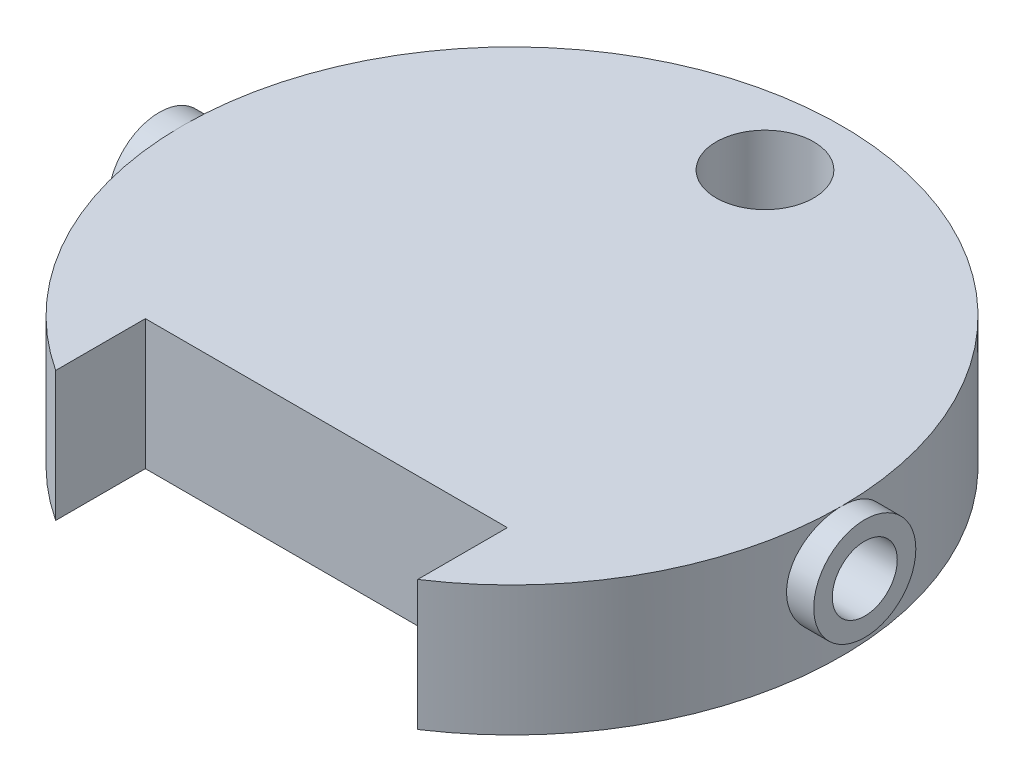
ISO-10303-21;
HEADER;
FILE_DESCRIPTION(('STEP AP214'),'2;1');
FILE_NAME('part.step','',(''),(''),'','','');
FILE_SCHEMA(('AUTOMOTIVE_DESIGN { 1 0 10303 214 1 1 1 1 }'));
ENDSEC;
DATA;
#1=APPLICATION_CONTEXT('core data for automotive mechanical design processes');
#2=APPLICATION_PROTOCOL_DEFINITION('international standard','automotive_design',2000,#1);
#3=PRODUCT_CONTEXT('',#1,'mechanical');
#4=PRODUCT('Part','Part','',(#3));
#5=PRODUCT_RELATED_PRODUCT_CATEGORY('part','',(#4));
#6=PRODUCT_DEFINITION_FORMATION('','',#4);
#7=PRODUCT_DEFINITION_CONTEXT('part definition',#1,'design');
#8=PRODUCT_DEFINITION('design','',#6,#7);
#9=PRODUCT_DEFINITION_SHAPE('','',#8);
#10=(LENGTH_UNIT() NAMED_UNIT(*) SI_UNIT(.MILLI.,.METRE.));
#11=(NAMED_UNIT(*) PLANE_ANGLE_UNIT() SI_UNIT($,.RADIAN.));
#12=(NAMED_UNIT(*) SI_UNIT($,.STERADIAN.) SOLID_ANGLE_UNIT());
#13=UNCERTAINTY_MEASURE_WITH_UNIT(LENGTH_MEASURE(1.E-05),#10,'distance_accuracy_value','');
#14=(GEOMETRIC_REPRESENTATION_CONTEXT(3) GLOBAL_UNCERTAINTY_ASSIGNED_CONTEXT((#13)) GLOBAL_UNIT_ASSIGNED_CONTEXT((#10,
#11,#12)) REPRESENTATION_CONTEXT('',''));
#15=CARTESIAN_POINT('',(0.,0.,0.));
#16=DIRECTION('',(0.,0.,1.));
#17=DIRECTION('',(1.,0.,0.));
#18=AXIS2_PLACEMENT_3D('',#15,#16,#17);
#19=CARTESIAN_POINT('',(-2.65,-0.85,-0.5));
#20=DIRECTION('',(-1.,0.,0.));
#21=DIRECTION('',(0.,0.,1.));
#22=AXIS2_PLACEMENT_3D('',#19,#20,#21);
#23=PLANE('',#22);
#24=CARTESIAN_POINT('',(-2.65,0.,0.));
#25=DIRECTION('',(-1.,0.,0.));
#26=DIRECTION('',(0.,0.,1.));
#27=AXIS2_PLACEMENT_3D('',#24,#25,#26);
#28=CIRCLE('',#27,0.35);
#29=CARTESIAN_POINT('',(-2.65,0.,0.35));
#30=VERTEX_POINT('',#29);
#31=EDGE_CURVE('E273',#30,#30,#28,.T.);
#32=ORIENTED_EDGE('',*,*,#31,.T.);
#33=EDGE_LOOP('',(#32));
#34=FACE_BOUND('',#33,.T.);
#35=DIRECTION('',(0.,0.,1.));
#36=VECTOR('',#35,1.);
#37=CARTESIAN_POINT('',(-2.65,0.45,-0.5));
#38=LINE('',#37,#36);
#39=CARTESIAN_POINT('',(-2.65,0.45,-0.5));
#40=VERTEX_POINT('',#39);
#41=CARTESIAN_POINT('',(-2.65,0.45,0.499999999999999));
#42=VERTEX_POINT('',#41);
#43=EDGE_CURVE('E132',#40,#42,#38,.T.);
#44=ORIENTED_EDGE('',*,*,#43,.T.);
#45=DIRECTION('',(0.,1.,0.));
#46=VECTOR('',#45,1.);
#47=CARTESIAN_POINT('',(-2.65,-0.85,0.5));
#48=LINE('',#47,#46);
#49=CARTESIAN_POINT('',(-2.65,-0.85,0.5));
#50=VERTEX_POINT('',#49);
#51=EDGE_CURVE('E117',#50,#42,#48,.T.);
#52=ORIENTED_EDGE('',*,*,#51,.F.);
#53=DIRECTION('',(0.,0.,1.));
#54=VECTOR('',#53,1.);
#55=CARTESIAN_POINT('',(-2.65,-0.85,-0.5));
#56=LINE('',#55,#54);
#57=CARTESIAN_POINT('',(-2.65,-0.85,-0.5));
#58=VERTEX_POINT('',#57);
#59=EDGE_CURVE('E234',#58,#50,#56,.T.);
#60=ORIENTED_EDGE('',*,*,#59,.F.);
#61=DIRECTION('',(0.,1.,0.));
#62=VECTOR('',#61,1.);
#63=CARTESIAN_POINT('',(-2.65,-0.85,-0.5));
#64=LINE('',#63,#62);
#65=EDGE_CURVE('E133',#58,#40,#64,.T.);
#66=ORIENTED_EDGE('',*,*,#65,.T.);
#67=EDGE_LOOP('',(#44,#52,#60,#66));
#68=FACE_BOUND('',#67,.T.);
#69=ADVANCED_FACE('F45',(#34,#68),#23,.F.);
#70=CARTESIAN_POINT('',(-2.65,-0.85,-0.5));
#71=DIRECTION('',(0.,0.,-1.));
#72=DIRECTION('',(-1.,0.,0.));
#73=AXIS2_PLACEMENT_3D('',#70,#71,#72);
#74=PLANE('',#73);
#75=DIRECTION('',(-1.,0.,0.));
#76=VECTOR('',#75,1.);
#77=CARTESIAN_POINT('',(-2.65,0.45,-0.5));
#78=LINE('',#77,#76);
#79=CARTESIAN_POINT('',(2.65,0.45,-0.500000000000001));
#80=VERTEX_POINT('',#79);
#81=EDGE_CURVE('E62',#80,#40,#78,.T.);
#82=ORIENTED_EDGE('',*,*,#81,.T.);
#83=ORIENTED_EDGE('',*,*,#65,.F.);
#84=DIRECTION('',(-1.,0.,0.));
#85=VECTOR('',#84,1.);
#86=CARTESIAN_POINT('',(-2.65,-0.85,-0.5));
#87=LINE('',#86,#85);
#88=CARTESIAN_POINT('',(2.65,-0.85,-0.500000000000001));
#89=VERTEX_POINT('',#88);
#90=EDGE_CURVE('E129',#89,#58,#87,.T.);
#91=ORIENTED_EDGE('',*,*,#90,.F.);
#92=DIRECTION('',(0.,1.,0.));
#93=VECTOR('',#92,1.);
#94=CARTESIAN_POINT('',(2.65,-0.85,-0.500000000000001));
#95=LINE('',#94,#93);
#96=EDGE_CURVE('E247',#89,#80,#95,.T.);
#97=ORIENTED_EDGE('',*,*,#96,.T.);
#98=EDGE_LOOP('',(#82,#83,#91,#97));
#99=FACE_BOUND('',#98,.T.);
#100=ADVANCED_FACE('F174',(#99),#74,.F.);
#101=CARTESIAN_POINT('',(2.65,-0.85,-0.500000000000001));
#102=DIRECTION('',(1.,0.,0.));
#103=DIRECTION('',(0.,0.,-1.));
#104=AXIS2_PLACEMENT_3D('',#101,#102,#103);
#105=PLANE('',#104);
#106=CARTESIAN_POINT('',(2.65,0.,0.));
#107=DIRECTION('',(1.,0.,0.));
#108=DIRECTION('',(0.,0.,-1.));
#109=AXIS2_PLACEMENT_3D('',#106,#107,#108);
#110=CIRCLE('',#109,0.35);
#111=CARTESIAN_POINT('',(2.65,0.,-0.35));
#112=VERTEX_POINT('',#111);
#113=EDGE_CURVE('E49',#112,#112,#110,.T.);
#114=ORIENTED_EDGE('',*,*,#113,.T.);
#115=EDGE_LOOP('',(#114));
#116=FACE_BOUND('',#115,.T.);
#117=DIRECTION('',(0.,0.,-1.));
#118=VECTOR('',#117,1.);
#119=CARTESIAN_POINT('',(2.65,0.45,-0.5));
#120=LINE('',#119,#118);
#121=CARTESIAN_POINT('',(2.65,0.45,0.499999999999999));
#122=VERTEX_POINT('',#121);
#123=EDGE_CURVE('E70',#122,#80,#120,.T.);
#124=ORIENTED_EDGE('',*,*,#123,.T.);
#125=ORIENTED_EDGE('',*,*,#96,.F.);
#126=DIRECTION('',(0.,0.,-1.));
#127=VECTOR('',#126,1.);
#128=CARTESIAN_POINT('',(2.65,-0.85,-0.500000000000001));
#129=LINE('',#128,#127);
#130=CARTESIAN_POINT('',(2.65,-0.85,0.499999999999999));
#131=VERTEX_POINT('',#130);
#132=EDGE_CURVE('E240',#131,#89,#129,.T.);
#133=ORIENTED_EDGE('',*,*,#132,.F.);
#134=DIRECTION('',(0.,1.,0.));
#135=VECTOR('',#134,1.);
#136=CARTESIAN_POINT('',(2.65,-0.85,0.499999999999999));
#137=LINE('',#136,#135);
#138=EDGE_CURVE('E128',#131,#122,#137,.T.);
#139=ORIENTED_EDGE('',*,*,#138,.T.);
#140=EDGE_LOOP('',(#124,#125,#133,#139));
#141=FACE_BOUND('',#140,.T.);
#142=ADVANCED_FACE('F180',(#116,#141),#105,.F.);
#143=CARTESIAN_POINT('',(-2.65,-0.85,0.5));
#144=DIRECTION('',(0.,0.,1.));
#145=DIRECTION('',(1.,0.,0.));
#146=AXIS2_PLACEMENT_3D('',#143,#144,#145);
#147=PLANE('',#146);
#148=DIRECTION('',(1.,0.,0.));
#149=VECTOR('',#148,1.);
#150=CARTESIAN_POINT('',(-2.65,0.45,0.499999999999999));
#151=LINE('',#150,#149);
#152=EDGE_CURVE('E122',#42,#122,#151,.T.);
#153=ORIENTED_EDGE('',*,*,#152,.T.);
#154=ORIENTED_EDGE('',*,*,#138,.F.);
#155=DIRECTION('',(1.,0.,0.));
#156=VECTOR('',#155,1.);
#157=CARTESIAN_POINT('',(-2.65,-0.85,0.5));
#158=LINE('',#157,#156);
#159=EDGE_CURVE('E124',#50,#131,#158,.T.);
#160=ORIENTED_EDGE('',*,*,#159,.F.);
#161=ORIENTED_EDGE('',*,*,#51,.T.);
#162=EDGE_LOOP('',(#153,#154,#160,#161));
#163=FACE_BOUND('',#162,.T.);
#164=ADVANCED_FACE('F119',(#163),#147,.F.);
#165=CARTESIAN_POINT('',(0.,-0.85,0.));
#166=DIRECTION('',(0.,1.,0.));
#167=DIRECTION('',(0.,0.,1.));
#168=AXIS2_PLACEMENT_3D('',#165,#166,#167);
#169=CYLINDRICAL_SURFACE('',#168,3.55);
#170=CARTESIAN_POINT('',(0.,0.55,0.));
#171=DIRECTION('',(0.,1.,0.));
#172=DIRECTION('',(0.,0.,1.));
#173=AXIS2_PLACEMENT_3D('',#170,#171,#172);
#174=CIRCLE('',#173,3.55);
#175=CARTESIAN_POINT('',(-3.55,0.55,0.));
#176=VERTEX_POINT('',#175);
#177=CARTESIAN_POINT('',(-1.95,0.55,2.96647939483827));
#178=VERTEX_POINT('',#177);
#179=EDGE_CURVE('E228',#176,#178,#174,.T.);
#180=ORIENTED_EDGE('',*,*,#179,.F.);
#181=CARTESIAN_POINT('',(-3.50713558335004,0.,0.55));
#182=CARTESIAN_POINT('',(-3.50713610931584,0.0306941712600289,0.549998741464487));
#183=CARTESIAN_POINT('',(-3.50754289515322,0.0614058596014954,0.547421856215872));
#184=CARTESIAN_POINT('',(-3.5091248753284,0.121969701652863,0.537185633231584));
#185=CARTESIAN_POINT('',(-3.51030080749153,0.151821001273753,0.529521415223453));
#186=CARTESIAN_POINT('',(-3.51328476840664,0.209778697197034,0.509346073474204));
#187=CARTESIAN_POINT('',(-3.51509229966173,0.237886446397332,0.496838763694981));
#188=CARTESIAN_POINT('',(-3.5191352054926,0.291600658103021,0.467341409365857));
#189=CARTESIAN_POINT('',(-3.5213705242354,0.317207446364997,0.450351949697311));
#190=CARTESIAN_POINT('',(-3.52603846359392,0.365415062802215,0.412217794503879));
#191=CARTESIAN_POINT('',(-3.52847245997991,0.387991454547622,0.39104237189678));
#192=CARTESIAN_POINT('',(-3.53325124220485,0.429285515342088,0.345203751688893));
#193=CARTESIAN_POINT('',(-3.53559602302581,0.448002967603467,0.320540358271873));
#194=CARTESIAN_POINT('',(-3.53994662430534,0.481138448495561,0.268268823788288));
#195=CARTESIAN_POINT('',(-3.54195064219784,0.495533903851411,0.240646210461065));
#196=CARTESIAN_POINT('',(-3.54537866024941,0.519471830629264,0.183338882422309));
#197=CARTESIAN_POINT('',(-3.54680269306128,0.529014575263362,0.153654283909422));
#198=CARTESIAN_POINT('',(-3.54890058337958,0.542901925064896,0.0933175326452187));
#199=CARTESIAN_POINT('',(-3.54958034947307,0.547287492978124,0.0626750168160162));
#200=CARTESIAN_POINT('',(-3.55013338005438,0.550863244039609,0.00108201260270235));
#201=CARTESIAN_POINT('',(-3.55000669222643,0.550053734363935,-0.0298684574645563));
#202=CARTESIAN_POINT('',(-3.54896579774752,0.543294526807402,-0.0909191562624063));
#203=CARTESIAN_POINT('',(-3.54805834372129,0.537388902486313,-0.121024396090948));
#204=CARTESIAN_POINT('',(-3.54556540180069,0.520674348409114,-0.179811368254253));
#205=CARTESIAN_POINT('',(-3.54397989551796,0.509865285674189,-0.208493061959747));
#206=CARTESIAN_POINT('',(-3.54029742005635,0.483605942068384,-0.263751509288593));
#207=CARTESIAN_POINT('',(-3.53819842494915,0.468137219548343,-0.290319358757163));
#208=CARTESIAN_POINT('',(-3.53372269701819,0.433011133884549,-0.340498875859438));
#209=CARTESIAN_POINT('',(-3.53134594471661,0.413353476910668,-0.364110335934557));
#210=CARTESIAN_POINT('',(-3.52655012724998,0.370162311036761,-0.40796680502866));
#211=CARTESIAN_POINT('',(-3.52413087975596,0.346590309921301,-0.428173904378596));
#212=CARTESIAN_POINT('',(-3.51954699617362,0.296370045883366,-0.464351714785132));
#213=CARTESIAN_POINT('',(-3.51738236185859,0.269721761538194,-0.480322396337505));
#214=CARTESIAN_POINT('',(-3.51355279935454,0.214064596195724,-0.507579805618324));
#215=CARTESIAN_POINT('',(-3.51188830750505,0.185053681847997,-0.51886244662302));
#216=CARTESIAN_POINT('',(-3.50925506017107,0.125517063226174,-0.536384354996999));
#217=CARTESIAN_POINT('',(-3.50828625220066,0.0949914734126746,-0.542624002839676));
#218=CARTESIAN_POINT('',(-3.50716407820933,0.0336298435931897,-0.549830416731066));
#219=CARTESIAN_POINT('',(-3.50700238861831,0.00280027195476128,-0.550851008038018));
#220=CARTESIAN_POINT('',(-3.50749063948571,-0.0585895093671188,-0.547733336012308));
#221=CARTESIAN_POINT('',(-3.50814055301437,-0.0891497279540763,-0.543595243849644));
#222=CARTESIAN_POINT('',(-3.51017112249939,-0.148965354961185,-0.53032339055252));
#223=CARTESIAN_POINT('',(-3.51154783041097,-0.178226895853904,-0.521216611128903));
#224=CARTESIAN_POINT('',(-3.51487359629874,-0.234808289856125,-0.498294024116603));
#225=CARTESIAN_POINT('',(-3.51682268426659,-0.262128041126253,-0.484477969764532));
#226=CARTESIAN_POINT('',(-3.52109313022897,-0.314291138650756,-0.452400351611576));
#227=CARTESIAN_POINT('',(-3.52341734673639,-0.339112881676024,-0.434104044865681));
#228=CARTESIAN_POINT('',(-3.52816763160819,-0.385352925965955,-0.393633409627346));
#229=CARTESIAN_POINT('',(-3.53059370612311,-0.406771021332102,-0.371458846695981));
#230=CARTESIAN_POINT('',(-3.53530045378161,-0.445790018483407,-0.323623699893454));
#231=CARTESIAN_POINT('',(-3.53757963772038,-0.463355184756402,-0.297933798324545));
#232=CARTESIAN_POINT('',(-3.54171245042087,-0.493920360144437,-0.243936602361937));
#233=CARTESIAN_POINT('',(-3.54356609144955,-0.506920500859338,-0.21562938344959));
#234=CARTESIAN_POINT('',(-3.54663245332926,-0.527929923496684,-0.157311113648978));
#235=CARTESIAN_POINT('',(-3.54784764969642,-0.535958504202802,-0.127307150921317));
#236=CARTESIAN_POINT('',(-3.54951061556781,-0.546859276122723,-0.0663566160358489));
#237=CARTESIAN_POINT('',(-3.5499584392953,-0.549731831666701,-0.0354101106362627));
#238=CARTESIAN_POINT('',(-3.55003559536114,-0.550229665095441,0.026200941823071));
#239=CARTESIAN_POINT('',(-3.54967344286087,-0.547909532770154,0.0568650510231499));
#240=CARTESIAN_POINT('',(-3.54818856876239,-0.538205164675676,0.117361422259243));
#241=CARTESIAN_POINT('',(-3.54706585008701,-0.530820948367563,0.147193687491542));
#242=CARTESIAN_POINT('',(-3.54418543966572,-0.511217849174518,0.205162871843964));
#243=CARTESIAN_POINT('',(-3.54242827700281,-0.499002993906364,0.233301180862715));
#244=CARTESIAN_POINT('',(-3.53847164025483,-0.470091241867123,0.287137443952396));
#245=CARTESIAN_POINT('',(-3.53627214989458,-0.453394180168459,0.312835308177438));
#246=CARTESIAN_POINT('',(-3.53164769976064,-0.415795682066542,0.361337574721096));
#247=CARTESIAN_POINT('',(-3.52922071265572,-0.394854029688251,0.384110611723526));
#248=CARTESIAN_POINT('',(-3.52442952322639,-0.349445405732176,0.425838985747292));
#249=CARTESIAN_POINT('',(-3.52206533575646,-0.324977608730262,0.444793426387258));
#250=CARTESIAN_POINT('',(-3.51765212246367,-0.273037364193211,0.478449840455305));
#251=CARTESIAN_POINT('',(-3.51560508107694,-0.245547703682281,0.493125507765082));
#252=CARTESIAN_POINT('',(-3.512081244906,-0.188474294217033,0.517629115484576));
#253=CARTESIAN_POINT('',(-3.51060386495273,-0.158892731287289,0.527462033370906));
#254=CARTESIAN_POINT('',(-3.50872407465987,-0.107652667391019,0.539796712116144));
#255=CARTESIAN_POINT('',(-3.50813159220014,-0.0863089485596777,0.543617010520217));
#256=CARTESIAN_POINT('',(-3.50733716375815,-0.0433130581127662,0.548719080335837));
#257=CARTESIAN_POINT('',(-3.50713521217572,-0.021660890924801,0.550000888149097));
#258=CARTESIAN_POINT('',(-3.50713558335004,0.,0.55));
#259=B_SPLINE_CURVE_WITH_KNOTS('',3,(#181,#182,#183,#184,#185,#186,#187,#188,#189,#190,#191,
#192,#193,#194,#195,#196,#197,#198,#199,#200,#201,#202,#203,#204,#205,#206,#207,#208,#209,#210,
#211,#212,#213,#214,#215,#216,#217,#218,#219,#220,#221,#222,#223,#224,#225,#226,#227,#228,#229,
#230,#231,#232,#233,#234,#235,#236,#237,#238,#239,#240,#241,#242,#243,#244,#245,#246,#247,#248,
#249,#250,#251,#252,#253,#254,#255,#256,#257,#258),.UNSPECIFIED.,.T.,.F.,(4,2,2,2,2,2,2,2,2,2,2,
2,2,2,2,2,2,2,2,2,2,2,2,2,2,2,2,2,2,2,2,2,2,2,2,2,2,2,4),(0.,0.0920033304865069,
0.18409504746144,0.276114388703854,0.368121728161346,0.46083136007846,0.553546198823214,
0.646737173439558,0.739922900736929,0.832363357091383,0.924798347649802,1.01644183942731,
1.10808781667938,1.20010137831443,1.29212139630766,1.38510664209892,1.47809253546224,
1.57115931857424,1.66421907951908,1.75631713123406,1.8484121271299,1.94001192169636,
2.0316165167792,2.12395531690607,2.21629970080433,2.30946740043299,2.40263241401684,
2.49543347112757,2.58822797055955,2.68005152545479,2.77187472747763,2.86362153140944,
2.95537171172583,3.04803564749111,3.14072131000675,3.23396534045337,3.32711333172957,
3.39204105588101,3.45696784896833),.UNSPECIFIED.);
#260=EDGE_CURVE('E141',#176,#176,#259,.T.);
#261=ORIENTED_EDGE('',*,*,#260,.F.);
#262=CARTESIAN_POINT('',(3.55,0.55,0.));
#263=VERTEX_POINT('',#262);
#264=EDGE_CURVE('E269',#263,#176,#174,.T.);
#265=ORIENTED_EDGE('',*,*,#264,.F.);
#266=CARTESIAN_POINT('',(3.50713558335004,0.,-0.55));
#267=CARTESIAN_POINT('',(3.50713610931584,-0.0306941712600289,-0.549998741464487));
#268=CARTESIAN_POINT('',(3.50754289515322,-0.0614058596014954,-0.547421856215872));
#269=CARTESIAN_POINT('',(3.5091248753284,-0.121969701652863,-0.537185633231584));
#270=CARTESIAN_POINT('',(3.51030080749153,-0.151821001273753,-0.529521415223453));
#271=CARTESIAN_POINT('',(3.51328476840664,-0.209778697197034,-0.509346073474204));
#272=CARTESIAN_POINT('',(3.51509229966173,-0.237886446397332,-0.496838763694981));
#273=CARTESIAN_POINT('',(3.5191352054926,-0.291600658103021,-0.467341409365857));
#274=CARTESIAN_POINT('',(3.5213705242354,-0.317207446364997,-0.450351949697311));
#275=CARTESIAN_POINT('',(3.52603846359392,-0.365415062802216,-0.412217794503879));
#276=CARTESIAN_POINT('',(3.52847245997991,-0.387991454547622,-0.39104237189678));
#277=CARTESIAN_POINT('',(3.53325124220485,-0.429285515342088,-0.345203751688893));
#278=CARTESIAN_POINT('',(3.53559602302581,-0.448002967603467,-0.320540358271872));
#279=CARTESIAN_POINT('',(3.53994662430534,-0.481138448495561,-0.268268823788288));
#280=CARTESIAN_POINT('',(3.54195064219784,-0.495533903851411,-0.240646210461064));
#281=CARTESIAN_POINT('',(3.54537866024941,-0.519471830629264,-0.183338882422308));
#282=CARTESIAN_POINT('',(3.54680269306128,-0.529014575263362,-0.153654283909422));
#283=CARTESIAN_POINT('',(3.54890058337958,-0.542901925064897,-0.0933175326452184));
#284=CARTESIAN_POINT('',(3.54958034947307,-0.547287492978124,-0.0626750168160159));
#285=CARTESIAN_POINT('',(3.55013338005438,-0.550863244039608,-0.00108201260270205));
#286=CARTESIAN_POINT('',(3.55000669222643,-0.550053734363935,0.0298684574645566));
#287=CARTESIAN_POINT('',(3.54896579774752,-0.543294526807402,0.0909191562624065));
#288=CARTESIAN_POINT('',(3.54805834372129,-0.537388902486313,0.121024396090949));
#289=CARTESIAN_POINT('',(3.54556540180069,-0.520674348409114,0.179811368254253));
#290=CARTESIAN_POINT('',(3.54397989551796,-0.509865285674189,0.208493061959747));
#291=CARTESIAN_POINT('',(3.54029742005635,-0.483605942068383,0.263751509288593));
#292=CARTESIAN_POINT('',(3.53819842494915,-0.468137219548343,0.290319358757164));
#293=CARTESIAN_POINT('',(3.53372269701819,-0.433011133884548,0.340498875859438));
#294=CARTESIAN_POINT('',(3.53134594471661,-0.413353476910668,0.364110335934557));
#295=CARTESIAN_POINT('',(3.52655012724998,-0.370162311036761,0.40796680502866));
#296=CARTESIAN_POINT('',(3.52413087975596,-0.346590309921301,0.428173904378596));
#297=CARTESIAN_POINT('',(3.51954699617362,-0.296370045883366,0.464351714785131));
#298=CARTESIAN_POINT('',(3.51738236185859,-0.269721761538194,0.480322396337505));
#299=CARTESIAN_POINT('',(3.51355279935454,-0.214064596195724,0.507579805618324));
#300=CARTESIAN_POINT('',(3.51188830750505,-0.185053681847997,0.51886244662302));
#301=CARTESIAN_POINT('',(3.50925506017107,-0.125517063226174,0.536384354996999));
#302=CARTESIAN_POINT('',(3.50828625220066,-0.0949914734126746,0.542624002839676));
#303=CARTESIAN_POINT('',(3.50716407820933,-0.0336298435931897,0.549830416731066));
#304=CARTESIAN_POINT('',(3.50700238861831,-0.00280027195476134,0.550851008038018));
#305=CARTESIAN_POINT('',(3.50749063948571,0.0585895093671188,0.547733336012308));
#306=CARTESIAN_POINT('',(3.50814055301437,0.0891497279540763,0.543595243849644));
#307=CARTESIAN_POINT('',(3.51017112249939,0.148965354961185,0.53032339055252));
#308=CARTESIAN_POINT('',(3.51154783041097,0.178226895853904,0.521216611128903));
#309=CARTESIAN_POINT('',(3.51487359629874,0.234808289856125,0.498294024116603));
#310=CARTESIAN_POINT('',(3.51682268426659,0.262128041126253,0.484477969764531));
#311=CARTESIAN_POINT('',(3.52109313022897,0.314291138650756,0.452400351611576));
#312=CARTESIAN_POINT('',(3.52341734673639,0.339112881676024,0.43410404486568));
#313=CARTESIAN_POINT('',(3.52816763160819,0.385352925965955,0.393633409627346));
#314=CARTESIAN_POINT('',(3.53059370612311,0.406771021332102,0.371458846695981));
#315=CARTESIAN_POINT('',(3.53530045378161,0.445790018483407,0.323623699893453));
#316=CARTESIAN_POINT('',(3.53757963772038,0.463355184756402,0.297933798324545));
#317=CARTESIAN_POINT('',(3.54171245042087,0.493920360144437,0.243936602361937));
#318=CARTESIAN_POINT('',(3.54356609144955,0.506920500859338,0.21562938344959));
#319=CARTESIAN_POINT('',(3.54663245332926,0.527929923496684,0.157311113648978));
#320=CARTESIAN_POINT('',(3.54784764969642,0.535958504202802,0.127307150921316));
#321=CARTESIAN_POINT('',(3.54951061556781,0.546859276122723,0.0663566160358487));
#322=CARTESIAN_POINT('',(3.5499584392953,0.549731831666701,0.0354101106362625));
#323=CARTESIAN_POINT('',(3.55003559536114,0.550229665095441,-0.0262009418230711));
#324=CARTESIAN_POINT('',(3.54967344286087,0.547909532770154,-0.0568650510231499));
#325=CARTESIAN_POINT('',(3.54818856876239,0.538205164675676,-0.117361422259243));
#326=CARTESIAN_POINT('',(3.54706585008701,0.530820948367563,-0.147193687491542));
#327=CARTESIAN_POINT('',(3.54418543966572,0.511217849174518,-0.205162871843964));
#328=CARTESIAN_POINT('',(3.54242827700281,0.499002993906364,-0.233301180862715));
#329=CARTESIAN_POINT('',(3.53847164025483,0.470091241867123,-0.287137443952396));
#330=CARTESIAN_POINT('',(3.53627214989458,0.453394180168459,-0.312835308177438));
#331=CARTESIAN_POINT('',(3.53164769976064,0.415795682066542,-0.361337574721096));
#332=CARTESIAN_POINT('',(3.52922071265572,0.394854029688251,-0.384110611723526));
#333=CARTESIAN_POINT('',(3.52442952322639,0.349445405732176,-0.425838985747292));
#334=CARTESIAN_POINT('',(3.52206533575646,0.324977608730262,-0.444793426387258));
#335=CARTESIAN_POINT('',(3.51765212246367,0.273037364193211,-0.478449840455305));
#336=CARTESIAN_POINT('',(3.51560508107694,0.245547703682281,-0.493125507765081));
#337=CARTESIAN_POINT('',(3.512081244906,0.188474294217033,-0.517629115484576));
#338=CARTESIAN_POINT('',(3.51060386495273,0.158892731287289,-0.527462033370906));
#339=CARTESIAN_POINT('',(3.50872407465987,0.107652667391019,-0.539796712116144));
#340=CARTESIAN_POINT('',(3.50813159220014,0.0863089485596777,-0.543617010520217));
#341=CARTESIAN_POINT('',(3.50733716375815,0.0433130581127662,-0.548719080335837));
#342=CARTESIAN_POINT('',(3.50713521217572,0.021660890924801,-0.550000888149097));
#343=CARTESIAN_POINT('',(3.50713558335004,0.,-0.55));
#344=B_SPLINE_CURVE_WITH_KNOTS('',3,(#266,#267,#268,#269,#270,#271,#272,#273,#274,#275,#276,
#277,#278,#279,#280,#281,#282,#283,#284,#285,#286,#287,#288,#289,#290,#291,#292,#293,#294,#295,
#296,#297,#298,#299,#300,#301,#302,#303,#304,#305,#306,#307,#308,#309,#310,#311,#312,#313,#314,
#315,#316,#317,#318,#319,#320,#321,#322,#323,#324,#325,#326,#327,#328,#329,#330,#331,#332,#333,
#334,#335,#336,#337,#338,#339,#340,#341,#342,#343),.UNSPECIFIED.,.T.,.F.,(4,2,2,2,2,2,2,2,2,2,2,
2,2,2,2,2,2,2,2,2,2,2,2,2,2,2,2,2,2,2,2,2,2,2,2,2,2,2,4),(0.,0.0920033304865069,
0.18409504746144,0.276114388703854,0.368121728161346,0.46083136007846,0.553546198823214,
0.646737173439558,0.73992290073693,0.832363357091383,0.924798347649802,1.01644183942731,
1.10808781667938,1.20010137831443,1.29212139630766,1.38510664209892,1.47809253546224,
1.57115931857424,1.66421907951907,1.75631713123406,1.8484121271299,1.94001192169636,
2.0316165167792,2.12395531690607,2.21629970080433,2.30946740043299,2.40263241401684,
2.49543347112757,2.58822797055955,2.68005152545479,2.77187472747763,2.86362153140944,
2.95537171172583,3.0480356474911,3.14072131000675,3.23396534045337,3.32711333172957,
3.39204105588101,3.45696784896833),.UNSPECIFIED.);
#345=EDGE_CURVE('E145',#263,#263,#344,.T.);
#346=ORIENTED_EDGE('',*,*,#345,.T.);
#347=CARTESIAN_POINT('',(1.95,0.55,2.96647939483826));
#348=VERTEX_POINT('',#347);
#349=EDGE_CURVE('E230',#348,#263,#174,.T.);
#350=ORIENTED_EDGE('',*,*,#349,.F.);
#351=DIRECTION('',(0.,1.,0.));
#352=VECTOR('',#351,1.);
#353=CARTESIAN_POINT('',(1.95,-0.85,2.96647939483826));
#354=LINE('',#353,#352);
#355=CARTESIAN_POINT('',(1.95,-0.85,2.96647939483826));
#356=VERTEX_POINT('',#355);
#357=EDGE_CURVE('E12',#356,#348,#354,.T.);
#358=ORIENTED_EDGE('',*,*,#357,.F.);
#359=CARTESIAN_POINT('',(0.,-0.85,0.));
#360=DIRECTION('',(0.,1.,0.));
#361=DIRECTION('',(0.,0.,1.));
#362=AXIS2_PLACEMENT_3D('',#359,#360,#361);
#363=CIRCLE('',#362,3.55);
#364=CARTESIAN_POINT('',(-1.95,-0.85,2.96647939483827));
#365=VERTEX_POINT('',#364);
#366=EDGE_CURVE('E252',#356,#365,#363,.T.);
#367=ORIENTED_EDGE('',*,*,#366,.T.);
#368=DIRECTION('',(0.,1.,0.));
#369=VECTOR('',#368,1.);
#370=CARTESIAN_POINT('',(-1.95,-0.85,2.96647939483827));
#371=LINE('',#370,#369);
#372=EDGE_CURVE('E218',#365,#178,#371,.T.);
#373=ORIENTED_EDGE('',*,*,#372,.T.);
#374=EDGE_LOOP('',(#180,#261,#265,#346,#350,#358,#367,#373));
#375=FACE_BOUND('',#374,.T.);
#376=ADVANCED_FACE('F47',(#375),#169,.T.);
#377=CARTESIAN_POINT('',(1.95,-0.85,2.96647939483826));
#378=DIRECTION('',(-1.,0.,0.));
#379=DIRECTION('',(0.,0.,1.));
#380=AXIS2_PLACEMENT_3D('',#377,#378,#379);
#381=PLANE('',#380);
#382=ORIENTED_EDGE('',*,*,#357,.T.);
#383=DIRECTION('',(0.,0.,1.));
#384=VECTOR('',#383,1.);
#385=CARTESIAN_POINT('',(1.95,0.55,2.96647939483826));
#386=LINE('',#385,#384);
#387=CARTESIAN_POINT('',(1.95,0.55,2.));
#388=VERTEX_POINT('',#387);
#389=EDGE_CURVE('E232',#388,#348,#386,.T.);
#390=ORIENTED_EDGE('',*,*,#389,.F.);
#391=DIRECTION('',(0.,1.,0.));
#392=VECTOR('',#391,1.);
#393=CARTESIAN_POINT('',(1.95,-0.85,2.));
#394=LINE('',#393,#392);
#395=CARTESIAN_POINT('',(1.95,-0.85,2.));
#396=VERTEX_POINT('',#395);
#397=EDGE_CURVE('E54',#396,#388,#394,.T.);
#398=ORIENTED_EDGE('',*,*,#397,.F.);
#399=DIRECTION('',(0.,0.,1.));
#400=VECTOR('',#399,1.);
#401=CARTESIAN_POINT('',(1.95,-0.85,2.96647939483826));
#402=LINE('',#401,#400);
#403=EDGE_CURVE('E257',#396,#356,#402,.T.);
#404=ORIENTED_EDGE('',*,*,#403,.T.);
#405=EDGE_LOOP('',(#382,#390,#398,#404));
#406=FACE_BOUND('',#405,.T.);
#407=ADVANCED_FACE('F196',(#406),#381,.T.);
#408=CARTESIAN_POINT('',(-1.95,-0.85,2.));
#409=DIRECTION('',(0.,0.,1.));
#410=DIRECTION('',(1.,0.,0.));
#411=AXIS2_PLACEMENT_3D('',#408,#409,#410);
#412=PLANE('',#411);
#413=ORIENTED_EDGE('',*,*,#397,.T.);
#414=DIRECTION('',(1.,0.,0.));
#415=VECTOR('',#414,1.);
#416=CARTESIAN_POINT('',(-1.95,0.55,2.));
#417=LINE('',#416,#415);
#418=CARTESIAN_POINT('',(-1.95,0.55,2.));
#419=VERTEX_POINT('',#418);
#420=EDGE_CURVE('E224',#419,#388,#417,.T.);
#421=ORIENTED_EDGE('',*,*,#420,.F.);
#422=DIRECTION('',(0.,1.,0.));
#423=VECTOR('',#422,1.);
#424=CARTESIAN_POINT('',(-1.95,-0.85,2.));
#425=LINE('',#424,#423);
#426=CARTESIAN_POINT('',(-1.95,-0.85,2.));
#427=VERTEX_POINT('',#426);
#428=EDGE_CURVE('E209',#427,#419,#425,.T.);
#429=ORIENTED_EDGE('',*,*,#428,.F.);
#430=DIRECTION('',(1.,0.,0.));
#431=VECTOR('',#430,1.);
#432=CARTESIAN_POINT('',(-1.95,-0.85,2.));
#433=LINE('',#432,#431);
#434=EDGE_CURVE('E255',#427,#396,#433,.T.);
#435=ORIENTED_EDGE('',*,*,#434,.T.);
#436=EDGE_LOOP('',(#413,#421,#429,#435));
#437=FACE_BOUND('',#436,.T.);
#438=ADVANCED_FACE('F199',(#437),#412,.T.);
#439=CARTESIAN_POINT('',(-1.95,-0.85,2.96647939483827));
#440=DIRECTION('',(1.,0.,0.));
#441=DIRECTION('',(0.,0.,-1.));
#442=AXIS2_PLACEMENT_3D('',#439,#440,#441);
#443=PLANE('',#442);
#444=ORIENTED_EDGE('',*,*,#428,.T.);
#445=DIRECTION('',(0.,0.,-1.));
#446=VECTOR('',#445,1.);
#447=CARTESIAN_POINT('',(-1.95,0.55,2.96647939483827));
#448=LINE('',#447,#446);
#449=EDGE_CURVE('E212',#178,#419,#448,.T.);
#450=ORIENTED_EDGE('',*,*,#449,.F.);
#451=ORIENTED_EDGE('',*,*,#372,.F.);
#452=DIRECTION('',(0.,0.,-1.));
#453=VECTOR('',#452,1.);
#454=CARTESIAN_POINT('',(-1.95,-0.85,2.96647939483827));
#455=LINE('',#454,#453);
#456=EDGE_CURVE('E214',#365,#427,#455,.T.);
#457=ORIENTED_EDGE('',*,*,#456,.T.);
#458=EDGE_LOOP('',(#444,#450,#451,#457));
#459=FACE_BOUND('',#458,.T.);
#460=ADVANCED_FACE('F194',(#459),#443,.T.);
#461=CARTESIAN_POINT('',(0.,-0.85,0.));
#462=DIRECTION('',(0.,1.,0.));
#463=DIRECTION('',(0.,0.,1.));
#464=AXIS2_PLACEMENT_3D('',#461,#462,#463);
#465=PLANE('',#464);
#466=ORIENTED_EDGE('',*,*,#90,.T.);
#467=ORIENTED_EDGE('',*,*,#59,.T.);
#468=ORIENTED_EDGE('',*,*,#159,.T.);
#469=ORIENTED_EDGE('',*,*,#132,.T.);
#470=EDGE_LOOP('',(#466,#467,#468,#469));
#471=FACE_BOUND('',#470,.T.);
#472=CARTESIAN_POINT('',(0.,-0.85,-2.725));
#473=DIRECTION('',(0.,1.,0.));
#474=DIRECTION('',(0.,0.,1.));
#475=AXIS2_PLACEMENT_3D('',#472,#473,#474);
#476=CIRCLE('',#475,0.525);
#477=CARTESIAN_POINT('',(0.,-0.85,-2.2));
#478=VERTEX_POINT('',#477);
#479=EDGE_CURVE('E246',#478,#478,#476,.T.);
#480=ORIENTED_EDGE('',*,*,#479,.T.);
#481=EDGE_LOOP('',(#480));
#482=FACE_BOUND('',#481,.T.);
#483=ORIENTED_EDGE('',*,*,#366,.F.);
#484=ORIENTED_EDGE('',*,*,#403,.F.);
#485=ORIENTED_EDGE('',*,*,#434,.F.);
#486=ORIENTED_EDGE('',*,*,#456,.F.);
#487=EDGE_LOOP('',(#483,#484,#485,#486));
#488=FACE_BOUND('',#487,.T.);
#489=ADVANCED_FACE('F190',(#471,#482,#488),#465,.F.);
#490=CARTESIAN_POINT('',(0.,-0.85,-2.725));
#491=DIRECTION('',(0.,1.,0.));
#492=DIRECTION('',(0.,0.,1.));
#493=AXIS2_PLACEMENT_3D('',#490,#491,#492);
#494=CYLINDRICAL_SURFACE('',#493,0.525);
#495=ORIENTED_EDGE('',*,*,#479,.F.);
#496=EDGE_LOOP('',(#495));
#497=FACE_BOUND('',#496,.T.);
#498=CARTESIAN_POINT('',(0.,0.55,-2.725));
#499=DIRECTION('',(0.,1.,0.));
#500=DIRECTION('',(0.,0.,1.));
#501=AXIS2_PLACEMENT_3D('',#498,#499,#500);
#502=CIRCLE('',#501,0.525);
#503=CARTESIAN_POINT('',(0.,0.55,-2.2));
#504=VERTEX_POINT('',#503);
#505=EDGE_CURVE('E271',#504,#504,#502,.T.);
#506=ORIENTED_EDGE('',*,*,#505,.T.);
#507=EDGE_LOOP('',(#506));
#508=FACE_BOUND('',#507,.T.);
#509=ADVANCED_FACE('F186',(#497,#508),#494,.F.);
#510=CARTESIAN_POINT('',(0.,0.55,0.));
#511=DIRECTION('',(0.,1.,0.));
#512=DIRECTION('',(0.,0.,1.));
#513=AXIS2_PLACEMENT_3D('',#510,#511,#512);
#514=PLANE('',#513);
#515=ORIENTED_EDGE('',*,*,#349,.T.);
#516=ORIENTED_EDGE('',*,*,#264,.T.);
#517=ORIENTED_EDGE('',*,*,#179,.T.);
#518=ORIENTED_EDGE('',*,*,#449,.T.);
#519=ORIENTED_EDGE('',*,*,#420,.T.);
#520=ORIENTED_EDGE('',*,*,#389,.T.);
#521=EDGE_LOOP('',(#515,#516,#517,#518,#519,#520));
#522=FACE_BOUND('',#521,.T.);
#523=ORIENTED_EDGE('',*,*,#505,.F.);
#524=EDGE_LOOP('',(#523));
#525=FACE_BOUND('',#524,.T.);
#526=ADVANCED_FACE('F189',(#522,#525),#514,.T.);
#527=CARTESIAN_POINT('',(-3.55,0.,0.));
#528=DIRECTION('',(1.,0.,0.));
#529=DIRECTION('',(0.,0.,-1.));
#530=AXIS2_PLACEMENT_3D('',#527,#528,#529);
#531=CYLINDRICAL_SURFACE('',#530,0.35);
#532=ORIENTED_EDGE('',*,*,#113,.F.);
#533=EDGE_LOOP('',(#532));
#534=FACE_BOUND('',#533,.T.);
#535=CARTESIAN_POINT('',(3.8,0.,0.));
#536=DIRECTION('',(1.,0.,0.));
#537=DIRECTION('',(0.,0.,-1.));
#538=AXIS2_PLACEMENT_3D('',#535,#536,#537);
#539=CIRCLE('',#538,0.35);
#540=CARTESIAN_POINT('',(3.8,0.,-0.35));
#541=VERTEX_POINT('',#540);
#542=EDGE_CURVE('E283',#541,#541,#539,.T.);
#543=ORIENTED_EDGE('',*,*,#542,.T.);
#544=EDGE_LOOP('',(#543));
#545=FACE_BOUND('',#544,.T.);
#546=ADVANCED_FACE('F295',(#534,#545),#531,.F.);
#547=ORIENTED_EDGE('',*,*,#31,.F.);
#548=EDGE_LOOP('',(#547));
#549=FACE_BOUND('',#548,.T.);
#550=CARTESIAN_POINT('',(-3.8,0.,0.));
#551=DIRECTION('',(1.,0.,0.));
#552=DIRECTION('',(0.,0.,-1.));
#553=AXIS2_PLACEMENT_3D('',#550,#551,#552);
#554=CIRCLE('',#553,0.35);
#555=CARTESIAN_POINT('',(-3.8,0.,-0.35));
#556=VERTEX_POINT('',#555);
#557=EDGE_CURVE('E146',#556,#556,#554,.T.);
#558=ORIENTED_EDGE('',*,*,#557,.F.);
#559=EDGE_LOOP('',(#558));
#560=FACE_BOUND('',#559,.T.);
#561=ADVANCED_FACE('F288',(#549,#560),#531,.F.);
#562=CARTESIAN_POINT('',(3.8,0.,0.));
#563=DIRECTION('',(1.,0.,0.));
#564=DIRECTION('',(0.,0.,-1.));
#565=AXIS2_PLACEMENT_3D('',#562,#563,#564);
#566=PLANE('',#565);
#567=ORIENTED_EDGE('',*,*,#542,.F.);
#568=EDGE_LOOP('',(#567));
#569=FACE_BOUND('',#568,.T.);
#570=CARTESIAN_POINT('',(3.8,0.,0.));
#571=DIRECTION('',(1.,0.,0.));
#572=DIRECTION('',(0.,0.,-1.));
#573=AXIS2_PLACEMENT_3D('',#570,#571,#572);
#574=CIRCLE('',#573,0.55);
#575=CARTESIAN_POINT('',(3.8,0.,-0.55));
#576=VERTEX_POINT('',#575);
#577=EDGE_CURVE('E155',#576,#576,#574,.T.);
#578=ORIENTED_EDGE('',*,*,#577,.T.);
#579=EDGE_LOOP('',(#578));
#580=FACE_BOUND('',#579,.T.);
#581=ADVANCED_FACE('F167',(#569,#580),#566,.T.);
#582=CARTESIAN_POINT('',(-3.552,0.,0.));
#583=DIRECTION('',(1.,0.,0.));
#584=DIRECTION('',(0.,0.,-1.));
#585=AXIS2_PLACEMENT_3D('',#582,#583,#584);
#586=CYLINDRICAL_SURFACE('',#585,0.55);
#587=ORIENTED_EDGE('',*,*,#345,.F.);
#588=EDGE_LOOP('',(#587));
#589=FACE_BOUND('',#588,.T.);
#590=ORIENTED_EDGE('',*,*,#577,.F.);
#591=EDGE_LOOP('',(#590));
#592=FACE_BOUND('',#591,.T.);
#593=ADVANCED_FACE('F165',(#589,#592),#586,.T.);
#594=CARTESIAN_POINT('',(-3.8,0.,0.));
#595=DIRECTION('',(-1.,0.,0.));
#596=DIRECTION('',(0.,0.,-1.));
#597=AXIS2_PLACEMENT_3D('',#594,#595,#596);
#598=PLANE('',#597);
#599=ORIENTED_EDGE('',*,*,#557,.T.);
#600=EDGE_LOOP('',(#599));
#601=FACE_BOUND('',#600,.T.);
#602=CARTESIAN_POINT('',(-3.8,0.,0.));
#603=DIRECTION('',(1.,0.,0.));
#604=DIRECTION('',(0.,0.,-1.));
#605=AXIS2_PLACEMENT_3D('',#602,#603,#604);
#606=CIRCLE('',#605,0.55);
#607=CARTESIAN_POINT('',(-3.8,0.,-0.55));
#608=VERTEX_POINT('',#607);
#609=EDGE_CURVE('E142',#608,#608,#606,.T.);
#610=ORIENTED_EDGE('',*,*,#609,.F.);
#611=EDGE_LOOP('',(#610));
#612=FACE_BOUND('',#611,.T.);
#613=ADVANCED_FACE('F162',(#601,#612),#598,.T.);
#614=CARTESIAN_POINT('',(3.802,0.,0.));
#615=DIRECTION('',(-1.,0.,0.));
#616=DIRECTION('',(0.,0.,1.));
#617=AXIS2_PLACEMENT_3D('',#614,#615,#616);
#618=CYLINDRICAL_SURFACE('',#617,0.55);
#619=ORIENTED_EDGE('',*,*,#260,.T.);
#620=EDGE_LOOP('',(#619));
#621=FACE_BOUND('',#620,.T.);
#622=ORIENTED_EDGE('',*,*,#609,.T.);
#623=EDGE_LOOP('',(#622));
#624=FACE_BOUND('',#623,.T.);
#625=ADVANCED_FACE('F157',(#621,#624),#618,.T.);
#626=CARTESIAN_POINT('',(0.,0.45,0.));
#627=DIRECTION('',(0.,1.,0.));
#628=DIRECTION('',(0.,0.,1.));
#629=AXIS2_PLACEMENT_3D('',#626,#627,#628);
#630=PLANE('',#629);
#631=ORIENTED_EDGE('',*,*,#43,.F.);
#632=ORIENTED_EDGE('',*,*,#81,.F.);
#633=ORIENTED_EDGE('',*,*,#123,.F.);
#634=ORIENTED_EDGE('',*,*,#152,.F.);
#635=EDGE_LOOP('',(#631,#632,#633,#634));
#636=FACE_BOUND('',#635,.T.);
#637=ADVANCED_FACE('F136',(#636),#630,.F.);
#638=CLOSED_SHELL('',(#69,#100,#142,#164,#376,#407,#438,#460,#489,#509,#526,#546,#561,#581,#593,
#613,#625,#637));
#639=MANIFOLD_SOLID_BREP('B2',#638);
#640=ADVANCED_BREP_SHAPE_REPRESENTATION('',(#18,#639),#14);
#641=SHAPE_DEFINITION_REPRESENTATION(#9,#640);
ENDSEC;
END-ISO-10303-21;
